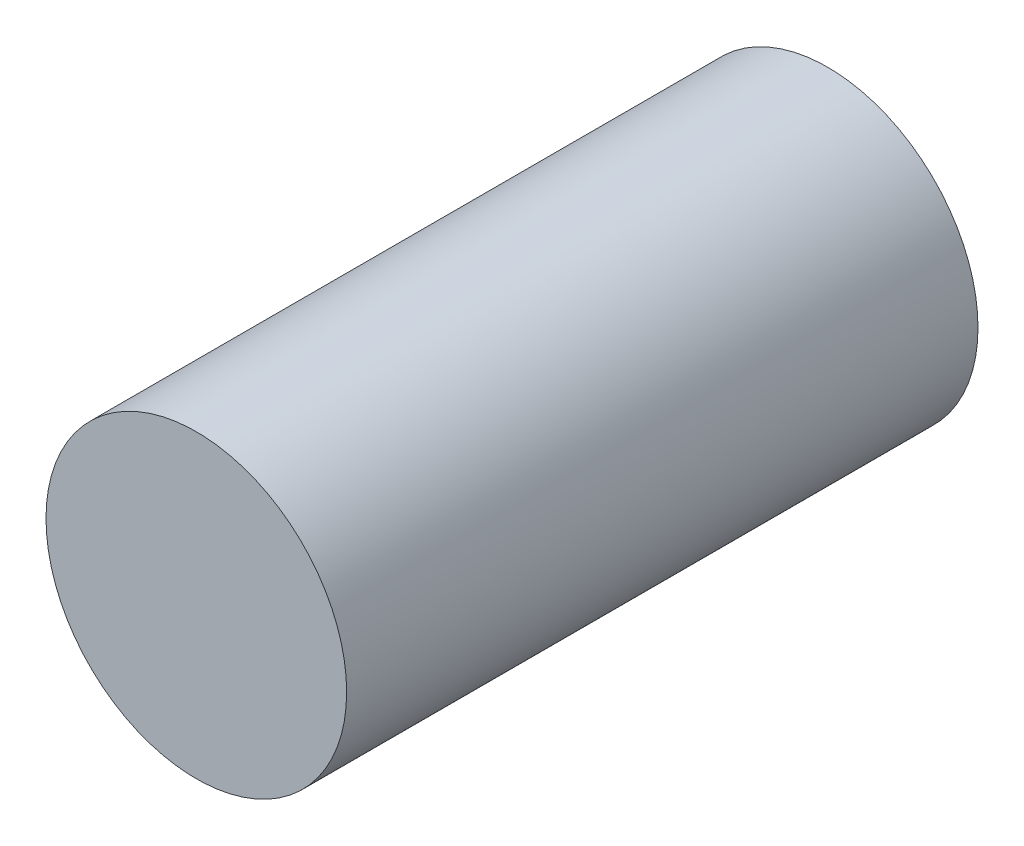
ISO-10303-21;
HEADER;
FILE_DESCRIPTION(('STEP AP214'),'2;1');
FILE_NAME('part.step','',(''),(''),'','','');
FILE_SCHEMA(('AUTOMOTIVE_DESIGN { 1 0 10303 214 1 1 1 1 }'));
ENDSEC;
DATA;
#1=APPLICATION_CONTEXT('core data for automotive mechanical design processes');
#2=APPLICATION_PROTOCOL_DEFINITION('international standard','automotive_design',2000,#1);
#3=PRODUCT_CONTEXT('',#1,'mechanical');
#4=PRODUCT('Part','Part','',(#3));
#5=PRODUCT_RELATED_PRODUCT_CATEGORY('part','',(#4));
#6=PRODUCT_DEFINITION_FORMATION('','',#4);
#7=PRODUCT_DEFINITION_CONTEXT('part definition',#1,'design');
#8=PRODUCT_DEFINITION('design','',#6,#7);
#9=PRODUCT_DEFINITION_SHAPE('','',#8);
#10=(LENGTH_UNIT() NAMED_UNIT(*) SI_UNIT(.MILLI.,.METRE.));
#11=(NAMED_UNIT(*) PLANE_ANGLE_UNIT() SI_UNIT($,.RADIAN.));
#12=(NAMED_UNIT(*) SI_UNIT($,.STERADIAN.) SOLID_ANGLE_UNIT());
#13=UNCERTAINTY_MEASURE_WITH_UNIT(LENGTH_MEASURE(1.E-05),#10,'distance_accuracy_value','');
#14=(GEOMETRIC_REPRESENTATION_CONTEXT(3) GLOBAL_UNCERTAINTY_ASSIGNED_CONTEXT((#13)) GLOBAL_UNIT_ASSIGNED_CONTEXT((#10,
#11,#12)) REPRESENTATION_CONTEXT('',''));
#15=CARTESIAN_POINT('',(0.,0.,0.));
#16=DIRECTION('',(0.,0.,1.));
#17=DIRECTION('',(1.,0.,0.));
#18=AXIS2_PLACEMENT_3D('',#15,#16,#17);
#19=CARTESIAN_POINT('',(-6.40149222587461,-1.58290996220956,0.75));
#20=DIRECTION('',(0.,0.,-1.));
#21=DIRECTION('',(-1.,0.,0.));
#22=AXIS2_PLACEMENT_3D('',#19,#20,#21);
#23=CYLINDRICAL_SURFACE('',#22,0.15);
#24=CARTESIAN_POINT('',(-6.40149222587461,-1.58290996220956,0.75));
#25=DIRECTION('',(0.,0.,1.));
#26=DIRECTION('',(1.,0.,0.));
#27=AXIS2_PLACEMENT_3D('',#24,#25,#26);
#28=CIRCLE('',#27,0.15);
#29=CARTESIAN_POINT('',(-6.25149222587461,-1.58290996220956,0.75));
#30=VERTEX_POINT('',#29);
#31=EDGE_CURVE('E10',#30,#30,#28,.T.);
#32=ORIENTED_EDGE('',*,*,#31,.F.);
#33=EDGE_LOOP('',(#32));
#34=FACE_BOUND('',#33,.T.);
#35=CARTESIAN_POINT('',(-6.40149222587461,-1.58290996220956,0.12));
#36=DIRECTION('',(0.,0.,-1.));
#37=DIRECTION('',(-1.,0.,0.));
#38=AXIS2_PLACEMENT_3D('',#35,#36,#37);
#39=CIRCLE('',#38,0.15);
#40=CARTESIAN_POINT('',(-6.55149222587461,-1.58290996220956,0.12));
#41=VERTEX_POINT('',#40);
#42=EDGE_CURVE('E32',#41,#41,#39,.T.);
#43=ORIENTED_EDGE('',*,*,#42,.F.);
#44=EDGE_LOOP('',(#43));
#45=FACE_BOUND('',#44,.T.);
#46=ADVANCED_FACE('F29',(#34,#45),#23,.T.);
#47=CARTESIAN_POINT('',(-6.40149222587461,-1.58290996220956,0.75));
#48=DIRECTION('',(0.,0.,1.));
#49=DIRECTION('',(1.,0.,0.));
#50=AXIS2_PLACEMENT_3D('',#47,#48,#49);
#51=PLANE('',#50);
#52=ORIENTED_EDGE('',*,*,#31,.T.);
#53=EDGE_LOOP('',(#52));
#54=FACE_BOUND('',#53,.T.);
#55=ADVANCED_FACE('F44',(#54),#51,.T.);
#56=CARTESIAN_POINT('',(-6.39602215284185,-1.61255486375467,0.12));
#57=DIRECTION('',(0.,0.,-1.));
#58=DIRECTION('',(-1.,0.,0.));
#59=AXIS2_PLACEMENT_3D('',#56,#57,#58);
#60=PLANE('',#59);
#61=ORIENTED_EDGE('',*,*,#42,.T.);
#62=EDGE_LOOP('',(#61));
#63=FACE_BOUND('',#62,.T.);
#64=ADVANCED_FACE('F41',(#63),#60,.T.);
#65=CLOSED_SHELL('',(#46,#55,#64));
#66=MANIFOLD_SOLID_BREP('B2',#65);
#67=ADVANCED_BREP_SHAPE_REPRESENTATION('',(#18,#66),#14);
#68=SHAPE_DEFINITION_REPRESENTATION(#9,#67);
ENDSEC;
END-ISO-10303-21;
